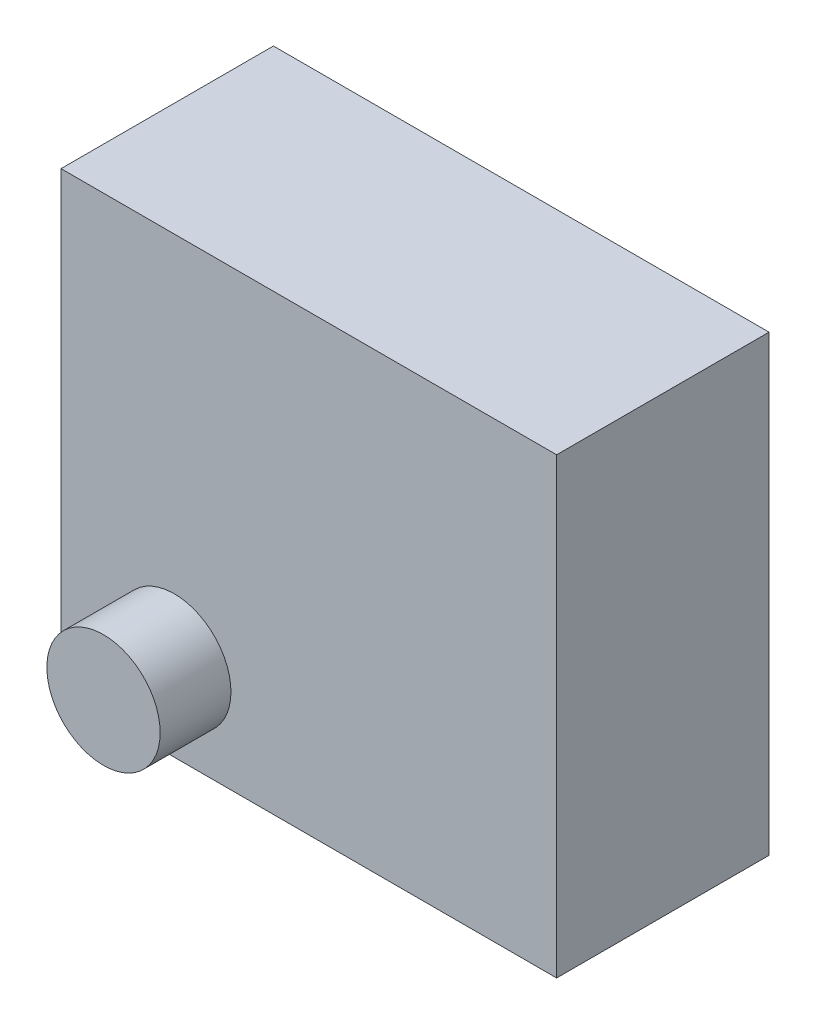
ISO-10303-21;
HEADER;
FILE_DESCRIPTION(('STEP AP214'),'2;1');
FILE_NAME('part.step','',(''),(''),'','','');
FILE_SCHEMA(('AUTOMOTIVE_DESIGN { 1 0 10303 214 1 1 1 1 }'));
ENDSEC;
DATA;
#1=APPLICATION_CONTEXT('core data for automotive mechanical design processes');
#2=APPLICATION_PROTOCOL_DEFINITION('international standard','automotive_design',2000,#1);
#3=PRODUCT_CONTEXT('',#1,'mechanical');
#4=PRODUCT('Part','Part','',(#3));
#5=PRODUCT_RELATED_PRODUCT_CATEGORY('part','',(#4));
#6=PRODUCT_DEFINITION_FORMATION('','',#4);
#7=PRODUCT_DEFINITION_CONTEXT('part definition',#1,'design');
#8=PRODUCT_DEFINITION('design','',#6,#7);
#9=PRODUCT_DEFINITION_SHAPE('','',#8);
#10=(LENGTH_UNIT() NAMED_UNIT(*) SI_UNIT(.MILLI.,.METRE.));
#11=(NAMED_UNIT(*) PLANE_ANGLE_UNIT() SI_UNIT($,.RADIAN.));
#12=(NAMED_UNIT(*) SI_UNIT($,.STERADIAN.) SOLID_ANGLE_UNIT());
#13=UNCERTAINTY_MEASURE_WITH_UNIT(LENGTH_MEASURE(1.E-05),#10,'distance_accuracy_value','');
#14=(GEOMETRIC_REPRESENTATION_CONTEXT(3) GLOBAL_UNCERTAINTY_ASSIGNED_CONTEXT((#13)) GLOBAL_UNIT_ASSIGNED_CONTEXT((#10,
#11,#12)) REPRESENTATION_CONTEXT('',''));
#15=CARTESIAN_POINT('',(0.,0.,0.));
#16=DIRECTION('',(0.,0.,1.));
#17=DIRECTION('',(1.,0.,0.));
#18=AXIS2_PLACEMENT_3D('',#15,#16,#17);
#19=CARTESIAN_POINT('',(175.,160.,150.));
#20=DIRECTION('',(-1.,0.,0.));
#21=DIRECTION('',(0.,-1.,0.));
#22=AXIS2_PLACEMENT_3D('',#19,#20,#21);
#23=PLANE('',#22);
#24=DIRECTION('',(0.,1.,0.));
#25=VECTOR('',#24,1.);
#26=CARTESIAN_POINT('',(175.,160.,0.));
#27=LINE('',#26,#25);
#28=CARTESIAN_POINT('',(175.,-160.,0.));
#29=VERTEX_POINT('',#28);
#30=CARTESIAN_POINT('',(175.,160.,0.));
#31=VERTEX_POINT('',#30);
#32=EDGE_CURVE('E107',#29,#31,#27,.T.);
#33=ORIENTED_EDGE('',*,*,#32,.T.);
#34=DIRECTION('',(0.,0.,-1.));
#35=VECTOR('',#34,1.);
#36=CARTESIAN_POINT('',(175.,160.,150.));
#37=LINE('',#36,#35);
#38=CARTESIAN_POINT('',(175.,160.,150.));
#39=VERTEX_POINT('',#38);
#40=EDGE_CURVE('E11',#39,#31,#37,.T.);
#41=ORIENTED_EDGE('',*,*,#40,.F.);
#42=DIRECTION('',(0.,1.,0.));
#43=VECTOR('',#42,1.);
#44=CARTESIAN_POINT('',(175.,160.,150.));
#45=LINE('',#44,#43);
#46=CARTESIAN_POINT('',(175.,-160.,150.));
#47=VERTEX_POINT('',#46);
#48=EDGE_CURVE('E91',#47,#39,#45,.T.);
#49=ORIENTED_EDGE('',*,*,#48,.F.);
#50=DIRECTION('',(0.,0.,-1.));
#51=VECTOR('',#50,1.);
#52=CARTESIAN_POINT('',(175.,-160.,150.));
#53=LINE('',#52,#51);
#54=EDGE_CURVE('E103',#47,#29,#53,.T.);
#55=ORIENTED_EDGE('',*,*,#54,.T.);
#56=EDGE_LOOP('',(#33,#41,#49,#55));
#57=FACE_BOUND('',#56,.T.);
#58=ADVANCED_FACE('F39',(#57),#23,.F.);
#59=CARTESIAN_POINT('',(-175.,160.,150.));
#60=DIRECTION('',(0.,-1.,0.));
#61=DIRECTION('',(0.,0.,-1.));
#62=AXIS2_PLACEMENT_3D('',#59,#60,#61);
#63=PLANE('',#62);
#64=DIRECTION('',(-1.,0.,0.));
#65=VECTOR('',#64,1.);
#66=CARTESIAN_POINT('',(-175.,160.,0.));
#67=LINE('',#66,#65);
#68=CARTESIAN_POINT('',(-175.,160.,0.));
#69=VERTEX_POINT('',#68);
#70=EDGE_CURVE('E96',#31,#69,#67,.T.);
#71=ORIENTED_EDGE('',*,*,#70,.T.);
#72=DIRECTION('',(0.,0.,-1.));
#73=VECTOR('',#72,1.);
#74=CARTESIAN_POINT('',(-175.,160.,150.));
#75=LINE('',#74,#73);
#76=CARTESIAN_POINT('',(-175.,160.,150.));
#77=VERTEX_POINT('',#76);
#78=EDGE_CURVE('E48',#77,#69,#75,.T.);
#79=ORIENTED_EDGE('',*,*,#78,.F.);
#80=DIRECTION('',(-1.,0.,0.));
#81=VECTOR('',#80,1.);
#82=CARTESIAN_POINT('',(-175.,160.,150.));
#83=LINE('',#82,#81);
#84=EDGE_CURVE('E86',#39,#77,#83,.T.);
#85=ORIENTED_EDGE('',*,*,#84,.F.);
#86=ORIENTED_EDGE('',*,*,#40,.T.);
#87=EDGE_LOOP('',(#71,#79,#85,#86));
#88=FACE_BOUND('',#87,.T.);
#89=ADVANCED_FACE('F95',(#88),#63,.F.);
#90=CARTESIAN_POINT('',(-175.,160.,150.));
#91=DIRECTION('',(1.,0.,0.));
#92=DIRECTION('',(0.,0.,-1.));
#93=AXIS2_PLACEMENT_3D('',#90,#91,#92);
#94=PLANE('',#93);
#95=DIRECTION('',(0.,-1.,0.));
#96=VECTOR('',#95,1.);
#97=CARTESIAN_POINT('',(-175.,160.,0.));
#98=LINE('',#97,#96);
#99=CARTESIAN_POINT('',(-175.,-160.,0.));
#100=VERTEX_POINT('',#99);
#101=EDGE_CURVE('E73',#69,#100,#98,.T.);
#102=ORIENTED_EDGE('',*,*,#101,.T.);
#103=DIRECTION('',(0.,0.,-1.));
#104=VECTOR('',#103,1.);
#105=CARTESIAN_POINT('',(-175.,-160.,150.));
#106=LINE('',#105,#104);
#107=CARTESIAN_POINT('',(-175.,-160.,150.));
#108=VERTEX_POINT('',#107);
#109=EDGE_CURVE('E98',#108,#100,#106,.T.);
#110=ORIENTED_EDGE('',*,*,#109,.F.);
#111=DIRECTION('',(0.,-1.,0.));
#112=VECTOR('',#111,1.);
#113=CARTESIAN_POINT('',(-175.,160.,150.));
#114=LINE('',#113,#112);
#115=EDGE_CURVE('E89',#77,#108,#114,.T.);
#116=ORIENTED_EDGE('',*,*,#115,.F.);
#117=ORIENTED_EDGE('',*,*,#78,.T.);
#118=EDGE_LOOP('',(#102,#110,#116,#117));
#119=FACE_BOUND('',#118,.T.);
#120=ADVANCED_FACE('F99',(#119),#94,.F.);
#121=CARTESIAN_POINT('',(-175.,-160.,150.));
#122=DIRECTION('',(0.,1.,0.));
#123=DIRECTION('',(0.,0.,1.));
#124=AXIS2_PLACEMENT_3D('',#121,#122,#123);
#125=PLANE('',#124);
#126=DIRECTION('',(1.,0.,0.));
#127=VECTOR('',#126,1.);
#128=CARTESIAN_POINT('',(-175.,-160.,0.));
#129=LINE('',#128,#127);
#130=EDGE_CURVE('E79',#100,#29,#129,.T.);
#131=ORIENTED_EDGE('',*,*,#130,.T.);
#132=ORIENTED_EDGE('',*,*,#54,.F.);
#133=DIRECTION('',(1.,0.,0.));
#134=VECTOR('',#133,1.);
#135=CARTESIAN_POINT('',(-175.,-160.,150.));
#136=LINE('',#135,#134);
#137=EDGE_CURVE('E56',#108,#47,#136,.T.);
#138=ORIENTED_EDGE('',*,*,#137,.F.);
#139=ORIENTED_EDGE('',*,*,#109,.T.);
#140=EDGE_LOOP('',(#131,#132,#138,#139));
#141=FACE_BOUND('',#140,.T.);
#142=ADVANCED_FACE('F121',(#141),#125,.F.);
#143=CARTESIAN_POINT('',(0.,0.,150.));
#144=DIRECTION('',(0.,0.,1.));
#145=DIRECTION('',(1.,0.,0.));
#146=AXIS2_PLACEMENT_3D('',#143,#144,#145);
#147=PLANE('',#146);
#148=CARTESIAN_POINT('',(-95.,-100.,150.));
#149=DIRECTION('',(0.,0.,1.));
#150=DIRECTION('',(1.,0.,0.));
#151=AXIS2_PLACEMENT_3D('',#148,#149,#150);
#152=CIRCLE('',#151,40.);
#153=CARTESIAN_POINT('',(-55.,-100.,150.));
#154=VERTEX_POINT('',#153);
#155=EDGE_CURVE('E128',#154,#154,#152,.T.);
#156=ORIENTED_EDGE('',*,*,#155,.F.);
#157=EDGE_LOOP('',(#156));
#158=FACE_BOUND('',#157,.T.);
#159=ORIENTED_EDGE('',*,*,#48,.T.);
#160=ORIENTED_EDGE('',*,*,#84,.T.);
#161=ORIENTED_EDGE('',*,*,#115,.T.);
#162=ORIENTED_EDGE('',*,*,#137,.T.);
#163=EDGE_LOOP('',(#159,#160,#161,#162));
#164=FACE_BOUND('',#163,.T.);
#165=ADVANCED_FACE('F87',(#158,#164),#147,.T.);
#166=CARTESIAN_POINT('',(0.,0.,0.));
#167=DIRECTION('',(0.,0.,1.));
#168=DIRECTION('',(1.,0.,0.));
#169=AXIS2_PLACEMENT_3D('',#166,#167,#168);
#170=PLANE('',#169);
#171=ORIENTED_EDGE('',*,*,#32,.F.);
#172=ORIENTED_EDGE('',*,*,#130,.F.);
#173=ORIENTED_EDGE('',*,*,#101,.F.);
#174=ORIENTED_EDGE('',*,*,#70,.F.);
#175=EDGE_LOOP('',(#171,#172,#173,#174));
#176=FACE_BOUND('',#175,.T.);
#177=ADVANCED_FACE('F124',(#176),#170,.F.);
#178=CARTESIAN_POINT('',(-95.,-100.,200.));
#179=DIRECTION('',(0.,0.,-1.));
#180=DIRECTION('',(-1.,0.,0.));
#181=AXIS2_PLACEMENT_3D('',#178,#179,#180);
#182=CYLINDRICAL_SURFACE('',#181,40.);
#183=CARTESIAN_POINT('',(-95.,-100.,200.));
#184=DIRECTION('',(0.,0.,1.));
#185=DIRECTION('',(1.,0.,0.));
#186=AXIS2_PLACEMENT_3D('',#183,#184,#185);
#187=CIRCLE('',#186,40.);
#188=CARTESIAN_POINT('',(-55.,-100.,200.));
#189=VERTEX_POINT('',#188);
#190=EDGE_CURVE('E111',#189,#189,#187,.T.);
#191=ORIENTED_EDGE('',*,*,#190,.F.);
#192=EDGE_LOOP('',(#191));
#193=FACE_BOUND('',#192,.T.);
#194=ORIENTED_EDGE('',*,*,#155,.T.);
#195=EDGE_LOOP('',(#194));
#196=FACE_BOUND('',#195,.T.);
#197=ADVANCED_FACE('F138',(#193,#196),#182,.T.);
#198=CARTESIAN_POINT('',(-95.,-100.,200.));
#199=DIRECTION('',(0.,0.,1.));
#200=DIRECTION('',(1.,0.,0.));
#201=AXIS2_PLACEMENT_3D('',#198,#199,#200);
#202=PLANE('',#201);
#203=ORIENTED_EDGE('',*,*,#190,.T.);
#204=EDGE_LOOP('',(#203));
#205=FACE_BOUND('',#204,.T.);
#206=ADVANCED_FACE('F136',(#205),#202,.T.);
#207=CLOSED_SHELL('',(#58,#89,#120,#142,#165,#177,#197,#206));
#208=MANIFOLD_SOLID_BREP('B2',#207);
#209=ADVANCED_BREP_SHAPE_REPRESENTATION('',(#18,#208),#14);
#210=SHAPE_DEFINITION_REPRESENTATION(#9,#209);
ENDSEC;
END-ISO-10303-21;
